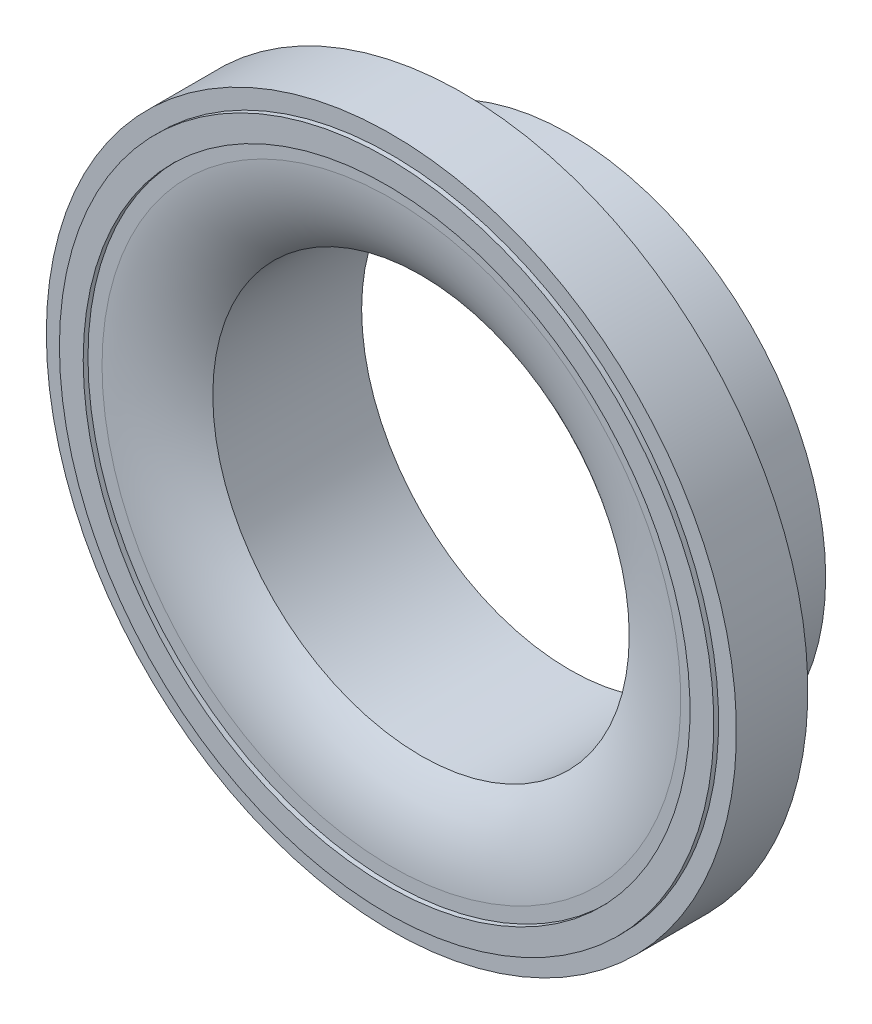
ISO-10303-21;
HEADER;
FILE_DESCRIPTION(('STEP AP214'),'2;1');
FILE_NAME('part.step','',(''),(''),'','','');
FILE_SCHEMA(('AUTOMOTIVE_DESIGN { 1 0 10303 214 1 1 1 1 }'));
ENDSEC;
DATA;
#1=APPLICATION_CONTEXT('core data for automotive mechanical design processes');
#2=APPLICATION_PROTOCOL_DEFINITION('international standard','automotive_design',2000,#1);
#3=PRODUCT_CONTEXT('',#1,'mechanical');
#4=PRODUCT('Part','Part','',(#3));
#5=PRODUCT_RELATED_PRODUCT_CATEGORY('part','',(#4));
#6=PRODUCT_DEFINITION_FORMATION('','',#4);
#7=PRODUCT_DEFINITION_CONTEXT('part definition',#1,'design');
#8=PRODUCT_DEFINITION('design','',#6,#7);
#9=PRODUCT_DEFINITION_SHAPE('','',#8);
#10=(LENGTH_UNIT() NAMED_UNIT(*) SI_UNIT(.MILLI.,.METRE.));
#11=(NAMED_UNIT(*) PLANE_ANGLE_UNIT() SI_UNIT($,.RADIAN.));
#12=(NAMED_UNIT(*) SI_UNIT($,.STERADIAN.) SOLID_ANGLE_UNIT());
#13=UNCERTAINTY_MEASURE_WITH_UNIT(LENGTH_MEASURE(1.E-05),#10,'distance_accuracy_value','');
#14=(GEOMETRIC_REPRESENTATION_CONTEXT(3) GLOBAL_UNCERTAINTY_ASSIGNED_CONTEXT((#13)) GLOBAL_UNIT_ASSIGNED_CONTEXT((#10,
#11,#12)) REPRESENTATION_CONTEXT('',''));
#15=CARTESIAN_POINT('',(0.,0.,0.));
#16=DIRECTION('',(0.,0.,1.));
#17=DIRECTION('',(1.,0.,0.));
#18=AXIS2_PLACEMENT_3D('',#15,#16,#17);
#19=CARTESIAN_POINT('',(0.,0.,0.100094239591726));
#20=DIRECTION('',(0.,0.,-1.));
#21=DIRECTION('',(-1.,0.,0.));
#22=AXIS2_PLACEMENT_3D('',#19,#20,#21);
#23=CYLINDRICAL_SURFACE('',#22,13.75);
#24=CARTESIAN_POINT('',(0.,0.,0.));
#25=DIRECTION('',(0.,0.,-1.));
#26=DIRECTION('',(-1.,0.,0.));
#27=AXIS2_PLACEMENT_3D('',#24,#25,#26);
#28=CIRCLE('',#27,13.75);
#29=CARTESIAN_POINT('',(-13.75,0.,0.));
#30=VERTEX_POINT('',#29);
#31=EDGE_CURVE('E19',#30,#30,#28,.T.);
#32=ORIENTED_EDGE('',*,*,#31,.F.);
#33=EDGE_LOOP('',(#32));
#34=FACE_BOUND('',#33,.T.);
#35=CARTESIAN_POINT('',(0.,0.,0.200188479183453));
#36=DIRECTION('',(0.,0.,-1.));
#37=DIRECTION('',(-1.,0.,0.));
#38=AXIS2_PLACEMENT_3D('',#35,#36,#37);
#39=CIRCLE('',#38,13.75);
#40=CARTESIAN_POINT('',(-13.75,0.,0.200188479183453));
#41=VERTEX_POINT('',#40);
#42=EDGE_CURVE('E57',#41,#41,#39,.F.);
#43=ORIENTED_EDGE('',*,*,#42,.F.);
#44=EDGE_LOOP('',(#43));
#45=FACE_BOUND('',#44,.T.);
#46=ADVANCED_FACE('F15',(#34,#45),#23,.T.);
#47=CARTESIAN_POINT('',(0.,14.5,0.));
#48=DIRECTION('',(0.,0.,1.));
#49=DIRECTION('',(1.,0.,0.));
#50=AXIS2_PLACEMENT_3D('',#47,#48,#49);
#51=PLANE('',#50);
#52=CARTESIAN_POINT('',(0.,0.,0.));
#53=DIRECTION('',(0.,0.,-1.));
#54=DIRECTION('',(-1.,0.,0.));
#55=AXIS2_PLACEMENT_3D('',#52,#53,#54);
#56=CIRCLE('',#55,14.5);
#57=CARTESIAN_POINT('',(-14.5,0.,0.));
#58=VERTEX_POINT('',#57);
#59=EDGE_CURVE('E55',#58,#58,#56,.T.);
#60=ORIENTED_EDGE('',*,*,#59,.F.);
#61=EDGE_LOOP('',(#60));
#62=FACE_BOUND('',#61,.T.);
#63=ORIENTED_EDGE('',*,*,#31,.T.);
#64=EDGE_LOOP('',(#63));
#65=FACE_BOUND('',#64,.T.);
#66=ADVANCED_FACE('F64',(#62,#65),#51,.T.);
#67=CARTESIAN_POINT('',(0.,13.75,0.200188479183453));
#68=DIRECTION('',(0.,0.,1.));
#69=DIRECTION('',(1.,0.,0.));
#70=AXIS2_PLACEMENT_3D('',#67,#68,#69);
#71=PLANE('',#70);
#72=ORIENTED_EDGE('',*,*,#42,.T.);
#73=EDGE_LOOP('',(#72));
#74=FACE_BOUND('',#73,.T.);
#75=CARTESIAN_POINT('',(0.,0.,0.200188479183453));
#76=DIRECTION('',(0.,0.,-1.));
#77=DIRECTION('',(-1.,0.,0.));
#78=AXIS2_PLACEMENT_3D('',#75,#76,#77);
#79=CIRCLE('',#78,12.75);
#80=CARTESIAN_POINT('',(-12.75,0.,0.200188479183453));
#81=VERTEX_POINT('',#80);
#82=EDGE_CURVE('E52',#81,#81,#79,.T.);
#83=ORIENTED_EDGE('',*,*,#82,.T.);
#84=EDGE_LOOP('',(#83));
#85=FACE_BOUND('',#84,.T.);
#86=ADVANCED_FACE('F72',(#74,#85),#71,.T.);
#87=CARTESIAN_POINT('',(0.,0.,-1.5));
#88=DIRECTION('',(0.,0.,-1.));
#89=DIRECTION('',(-1.,0.,0.));
#90=AXIS2_PLACEMENT_3D('',#87,#88,#89);
#91=CYLINDRICAL_SURFACE('',#90,14.5);
#92=ORIENTED_EDGE('',*,*,#59,.T.);
#93=EDGE_LOOP('',(#92));
#94=FACE_BOUND('',#93,.T.);
#95=CARTESIAN_POINT('',(0.,0.,-3.));
#96=DIRECTION('',(0.,0.,-1.));
#97=DIRECTION('',(-1.,0.,0.));
#98=AXIS2_PLACEMENT_3D('',#95,#96,#97);
#99=CIRCLE('',#98,14.5);
#100=CARTESIAN_POINT('',(-14.5,0.,-3.));
#101=VERTEX_POINT('',#100);
#102=EDGE_CURVE('E49',#101,#101,#99,.T.);
#103=ORIENTED_EDGE('',*,*,#102,.F.);
#104=EDGE_LOOP('',(#103));
#105=FACE_BOUND('',#104,.T.);
#106=ADVANCED_FACE('F113',(#94,#105),#91,.T.);
#107=CARTESIAN_POINT('',(0.,0.,0.100094239591726));
#108=DIRECTION('',(0.,0.,-1.));
#109=DIRECTION('',(-1.,0.,0.));
#110=AXIS2_PLACEMENT_3D('',#107,#108,#109);
#111=CYLINDRICAL_SURFACE('',#110,12.75);
#112=ORIENTED_EDGE('',*,*,#82,.F.);
#113=EDGE_LOOP('',(#112));
#114=FACE_BOUND('',#113,.T.);
#115=CARTESIAN_POINT('',(0.,0.,0.));
#116=DIRECTION('',(0.,0.,-1.));
#117=DIRECTION('',(-1.,0.,0.));
#118=AXIS2_PLACEMENT_3D('',#115,#116,#117);
#119=CIRCLE('',#118,12.75);
#120=CARTESIAN_POINT('',(-12.75,0.,0.));
#121=VERTEX_POINT('',#120);
#122=EDGE_CURVE('E46',#121,#121,#119,.T.);
#123=ORIENTED_EDGE('',*,*,#122,.T.);
#124=EDGE_LOOP('',(#123));
#125=FACE_BOUND('',#124,.T.);
#126=ADVANCED_FACE('F109',(#114,#125),#111,.F.);
#127=CARTESIAN_POINT('',(0.,13.,-3.));
#128=DIRECTION('',(0.,0.,-1.));
#129=DIRECTION('',(-1.,0.,0.));
#130=AXIS2_PLACEMENT_3D('',#127,#128,#129);
#131=PLANE('',#130);
#132=ORIENTED_EDGE('',*,*,#102,.T.);
#133=EDGE_LOOP('',(#132));
#134=FACE_BOUND('',#133,.T.);
#135=CARTESIAN_POINT('',(0.,0.,-3.));
#136=DIRECTION('',(0.,0.,-1.));
#137=DIRECTION('',(-1.,0.,0.));
#138=AXIS2_PLACEMENT_3D('',#135,#136,#137);
#139=CIRCLE('',#138,13.);
#140=CARTESIAN_POINT('',(-13.,0.,-3.));
#141=VERTEX_POINT('',#140);
#142=EDGE_CURVE('E43',#141,#141,#139,.F.);
#143=ORIENTED_EDGE('',*,*,#142,.T.);
#144=EDGE_LOOP('',(#143));
#145=FACE_BOUND('',#144,.T.);
#146=ADVANCED_FACE('F105',(#134,#145),#131,.T.);
#147=CARTESIAN_POINT('',(0.,12.159440087285,0.));
#148=DIRECTION('',(0.,0.,-1.));
#149=DIRECTION('',(-1.,0.,0.));
#150=AXIS2_PLACEMENT_3D('',#147,#148,#149);
#151=PLANE('',#150);
#152=ORIENTED_EDGE('',*,*,#122,.F.);
#153=EDGE_LOOP('',(#152));
#154=FACE_BOUND('',#153,.T.);
#155=CARTESIAN_POINT('',(0.,0.,0.));
#156=DIRECTION('',(0.,0.,-1.));
#157=DIRECTION('',(-1.,0.,0.));
#158=AXIS2_PLACEMENT_3D('',#155,#156,#157);
#159=CIRCLE('',#158,12.1594400872851);
#160=CARTESIAN_POINT('',(-12.1594400872851,0.,0.));
#161=VERTEX_POINT('',#160);
#162=EDGE_CURVE('E32',#161,#161,#159,.F.);
#163=ORIENTED_EDGE('',*,*,#162,.F.);
#164=EDGE_LOOP('',(#163));
#165=FACE_BOUND('',#164,.T.);
#166=ADVANCED_FACE('F101',(#154,#165),#151,.F.);
#167=CARTESIAN_POINT('',(0.,0.,-2.12271875392521));
#168=DIRECTION('',(0.,0.,-1.));
#169=DIRECTION('',(-1.,0.,0.));
#170=AXIS2_PLACEMENT_3D('',#167,#168,#169);
#171=CYLINDRICAL_SURFACE('',#170,13.);
#172=ORIENTED_EDGE('',*,*,#142,.F.);
#173=EDGE_LOOP('',(#172));
#174=FACE_BOUND('',#173,.T.);
#175=CARTESIAN_POINT('',(0.,0.,-1.24543750785041));
#176=DIRECTION('',(0.,0.,-1.));
#177=DIRECTION('',(-1.,0.,0.));
#178=AXIS2_PLACEMENT_3D('',#175,#176,#177);
#179=CIRCLE('',#178,13.);
#180=CARTESIAN_POINT('',(-13.,0.,-1.24543750785041));
#181=VERTEX_POINT('',#180);
#182=EDGE_CURVE('E40',#181,#181,#179,.T.);
#183=ORIENTED_EDGE('',*,*,#182,.F.);
#184=EDGE_LOOP('',(#183));
#185=FACE_BOUND('',#184,.T.);
#186=ADVANCED_FACE('F98',(#174,#185),#171,.F.);
#187=CARTESIAN_POINT('',(0.,0.,-6.09780693104238));
#188=DIRECTION('',(0.,0.,-1.));
#189=DIRECTION('',(-1.,0.,0.));
#190=AXIS2_PLACEMENT_3D('',#187,#188,#189);
#191=TOROIDAL_SURFACE('',#190,12.4547200436425,6.1049520572151);
#192=ORIENTED_EDGE('',*,*,#162,.T.);
#193=EDGE_LOOP('',(#192));
#194=FACE_BOUND('',#193,.T.);
#195=CARTESIAN_POINT('',(0.,0.,-1.24543750785041));
#196=DIRECTION('',(0.,0.,-1.));
#197=DIRECTION('',(-1.,0.,0.));
#198=AXIS2_PLACEMENT_3D('',#195,#196,#197);
#199=CIRCLE('',#198,8.75);
#200=CARTESIAN_POINT('',(-8.75,0.,-1.24543750785041));
#201=VERTEX_POINT('',#200);
#202=EDGE_CURVE('E39',#201,#201,#199,.T.);
#203=ORIENTED_EDGE('',*,*,#202,.T.);
#204=EDGE_LOOP('',(#203));
#205=FACE_BOUND('',#204,.T.);
#206=ADVANCED_FACE('F17',(#194,#205),#191,.T.);
#207=CARTESIAN_POINT('',(0.,11.8248304353358,-1.24543750785041));
#208=DIRECTION('',(0.,0.,-1.));
#209=DIRECTION('',(-1.,0.,0.));
#210=AXIS2_PLACEMENT_3D('',#207,#208,#209);
#211=PLANE('',#210);
#212=ORIENTED_EDGE('',*,*,#182,.T.);
#213=EDGE_LOOP('',(#212));
#214=FACE_BOUND('',#213,.T.);
#215=CARTESIAN_POINT('',(0.,0.,-1.24543750785199));
#216=DIRECTION('',(0.,0.,1.));
#217=DIRECTION('',(1.,0.,0.));
#218=AXIS2_PLACEMENT_3D('',#215,#216,#217);
#219=CIRCLE('',#218,11.8248304353371);
#220=CARTESIAN_POINT('',(11.8248304353371,0.,-1.245437507852));
#221=VERTEX_POINT('',#220);
#222=EDGE_CURVE('E36',#221,#221,#219,.F.);
#223=ORIENTED_EDGE('',*,*,#222,.F.);
#224=EDGE_LOOP('',(#223));
#225=FACE_BOUND('',#224,.T.);
#226=ADVANCED_FACE('F93',(#214,#225),#211,.T.);
#227=CARTESIAN_POINT('',(0.,0.,-4.37271875392521));
#228=DIRECTION('',(0.,0.,-1.));
#229=DIRECTION('',(-1.,0.,0.));
#230=AXIS2_PLACEMENT_3D('',#227,#228,#229);
#231=CYLINDRICAL_SURFACE('',#230,8.75);
#232=ORIENTED_EDGE('',*,*,#202,.F.);
#233=EDGE_LOOP('',(#232));
#234=FACE_BOUND('',#233,.T.);
#235=CARTESIAN_POINT('',(0.,0.,-7.5));
#236=DIRECTION('',(0.,0.,-1.));
#237=DIRECTION('',(-1.,0.,0.));
#238=AXIS2_PLACEMENT_3D('',#235,#236,#237);
#239=CIRCLE('',#238,8.75);
#240=CARTESIAN_POINT('',(-8.75,0.,-7.5));
#241=VERTEX_POINT('',#240);
#242=EDGE_CURVE('E28',#241,#241,#239,.F.);
#243=ORIENTED_EDGE('',*,*,#242,.F.);
#244=EDGE_LOOP('',(#243));
#245=FACE_BOUND('',#244,.T.);
#246=ADVANCED_FACE('F89',(#234,#245),#231,.F.);
#247=CARTESIAN_POINT('',(0.,0.,-1.24543750785199));
#248=DIRECTION('',(0.,0.,1.));
#249=DIRECTION('',(1.,0.,0.));
#250=AXIS2_PLACEMENT_3D('',#247,#248,#249);
#251=CONICAL_SURFACE('',#250,11.8248304353371,0.901581798840474);
#252=ORIENTED_EDGE('',*,*,#222,.T.);
#253=EDGE_LOOP('',(#252));
#254=FACE_BOUND('',#253,.T.);
#255=CARTESIAN_POINT('',(0.,0.,-2.09560310530084));
#256=DIRECTION('',(0.,0.,-1.));
#257=DIRECTION('',(-1.,0.,0.));
#258=AXIS2_PLACEMENT_3D('',#255,#256,#257);
#259=CIRCLE('',#258,10.75);
#260=CARTESIAN_POINT('',(-10.75,0.,-2.09560310530084));
#261=VERTEX_POINT('',#260);
#262=EDGE_CURVE('E23',#261,#261,#259,.T.);
#263=ORIENTED_EDGE('',*,*,#262,.F.);
#264=EDGE_LOOP('',(#263));
#265=FACE_BOUND('',#264,.T.);
#266=ADVANCED_FACE('F82',(#254,#265),#251,.T.);
#267=CARTESIAN_POINT('',(0.,8.75,-7.5));
#268=DIRECTION('',(0.,0.,-1.));
#269=DIRECTION('',(-1.,0.,0.));
#270=AXIS2_PLACEMENT_3D('',#267,#268,#269);
#271=PLANE('',#270);
#272=CARTESIAN_POINT('',(0.,0.,-7.5));
#273=DIRECTION('',(0.,0.,-1.));
#274=DIRECTION('',(-1.,0.,0.));
#275=AXIS2_PLACEMENT_3D('',#272,#273,#274);
#276=CIRCLE('',#275,10.75);
#277=CARTESIAN_POINT('',(-10.75,0.,-7.5));
#278=VERTEX_POINT('',#277);
#279=EDGE_CURVE('E10',#278,#278,#276,.F.);
#280=ORIENTED_EDGE('',*,*,#279,.F.);
#281=EDGE_LOOP('',(#280));
#282=FACE_BOUND('',#281,.T.);
#283=ORIENTED_EDGE('',*,*,#242,.T.);
#284=EDGE_LOOP('',(#283));
#285=FACE_BOUND('',#284,.T.);
#286=ADVANCED_FACE('F77',(#282,#285),#271,.T.);
#287=CARTESIAN_POINT('',(0.,0.,-4.79780155265042));
#288=DIRECTION('',(0.,0.,-1.));
#289=DIRECTION('',(-1.,0.,0.));
#290=AXIS2_PLACEMENT_3D('',#287,#288,#289);
#291=CYLINDRICAL_SURFACE('',#290,10.75);
#292=ORIENTED_EDGE('',*,*,#279,.T.);
#293=EDGE_LOOP('',(#292));
#294=FACE_BOUND('',#293,.T.);
#295=ORIENTED_EDGE('',*,*,#262,.T.);
#296=EDGE_LOOP('',(#295));
#297=FACE_BOUND('',#296,.T.);
#298=ADVANCED_FACE('F75',(#294,#297),#291,.T.);
#299=CLOSED_SHELL('',(#46,#66,#86,#106,#126,#146,#166,#186,#206,#226,#246,#266,#286,#298));
#300=MANIFOLD_SOLID_BREP('B1',#299);
#301=ADVANCED_BREP_SHAPE_REPRESENTATION('',(#18,#300),#14);
#302=SHAPE_DEFINITION_REPRESENTATION(#9,#301);
ENDSEC;
END-ISO-10303-21;
